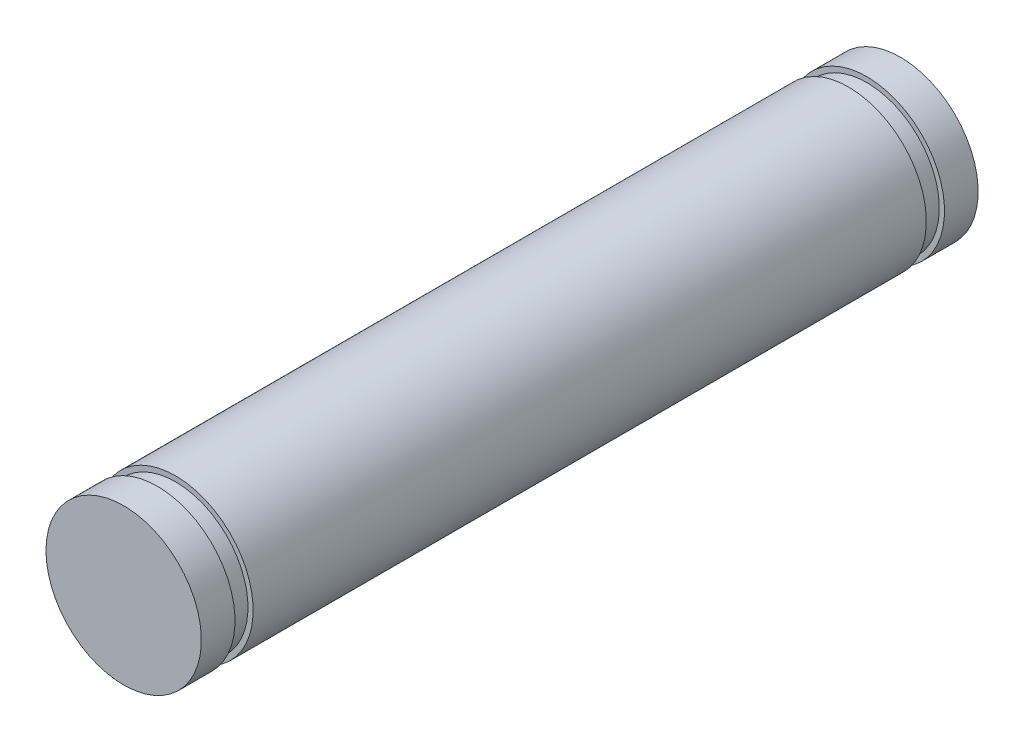
ISO-10303-21;
HEADER;
FILE_DESCRIPTION(('STEP AP214'),'2;1');
FILE_NAME('part.step','',(''),(''),'','','');
FILE_SCHEMA(('AUTOMOTIVE_DESIGN { 1 0 10303 214 1 1 1 1 }'));
ENDSEC;
DATA;
#1=APPLICATION_CONTEXT('core data for automotive mechanical design processes');
#2=APPLICATION_PROTOCOL_DEFINITION('international standard','automotive_design',2000,#1);
#3=PRODUCT_CONTEXT('',#1,'mechanical');
#4=PRODUCT('Part','Part','',(#3));
#5=PRODUCT_RELATED_PRODUCT_CATEGORY('part','',(#4));
#6=PRODUCT_DEFINITION_FORMATION('','',#4);
#7=PRODUCT_DEFINITION_CONTEXT('part definition',#1,'design');
#8=PRODUCT_DEFINITION('design','',#6,#7);
#9=PRODUCT_DEFINITION_SHAPE('','',#8);
#10=(LENGTH_UNIT() NAMED_UNIT(*) SI_UNIT(.MILLI.,.METRE.));
#11=(NAMED_UNIT(*) PLANE_ANGLE_UNIT() SI_UNIT($,.RADIAN.));
#12=(NAMED_UNIT(*) SI_UNIT($,.STERADIAN.) SOLID_ANGLE_UNIT());
#13=UNCERTAINTY_MEASURE_WITH_UNIT(LENGTH_MEASURE(1.E-05),#10,'distance_accuracy_value','');
#14=(GEOMETRIC_REPRESENTATION_CONTEXT(3) GLOBAL_UNCERTAINTY_ASSIGNED_CONTEXT((#13)) GLOBAL_UNIT_ASSIGNED_CONTEXT((#10,
#11,#12)) REPRESENTATION_CONTEXT('',''));
#15=CARTESIAN_POINT('',(0.,0.,0.));
#16=DIRECTION('',(0.,0.,1.));
#17=DIRECTION('',(1.,0.,0.));
#18=AXIS2_PLACEMENT_3D('',#15,#16,#17);
#19=CARTESIAN_POINT('',(0.,0.,30.));
#20=DIRECTION('',(0.,0.,1.));
#21=DIRECTION('',(1.,0.,0.));
#22=AXIS2_PLACEMENT_3D('',#19,#20,#21);
#23=PLANE('',#22);
#24=CARTESIAN_POINT('',(0.,0.,30.));
#25=DIRECTION('',(0.,0.,-1.));
#26=DIRECTION('',(-1.,0.,0.));
#27=AXIS2_PLACEMENT_3D('',#24,#25,#26);
#28=CIRCLE('',#27,3.);
#29=CARTESIAN_POINT('',(-3.,0.,30.));
#30=VERTEX_POINT('',#29);
#31=EDGE_CURVE('E18',#30,#30,#28,.T.);
#32=ORIENTED_EDGE('',*,*,#31,.F.);
#33=EDGE_LOOP('',(#32));
#34=FACE_BOUND('',#33,.T.);
#35=ADVANCED_FACE('F15',(#34),#23,.T.);
#36=CARTESIAN_POINT('',(0.,0.,0.));
#37=DIRECTION('',(0.,0.,1.));
#38=DIRECTION('',(1.,0.,0.));
#39=AXIS2_PLACEMENT_3D('',#36,#37,#38);
#40=PLANE('',#39);
#41=CARTESIAN_POINT('',(0.,0.,0.));
#42=DIRECTION('',(0.,0.,-1.));
#43=DIRECTION('',(-1.,0.,0.));
#44=AXIS2_PLACEMENT_3D('',#41,#42,#43);
#45=CIRCLE('',#44,3.);
#46=CARTESIAN_POINT('',(-3.,0.,0.));
#47=VERTEX_POINT('',#46);
#48=EDGE_CURVE('E46',#47,#47,#45,.F.);
#49=ORIENTED_EDGE('',*,*,#48,.F.);
#50=EDGE_LOOP('',(#49));
#51=FACE_BOUND('',#50,.T.);
#52=ADVANCED_FACE('F57',(#51),#40,.F.);
#53=CARTESIAN_POINT('',(0.,0.,30.));
#54=DIRECTION('',(0.,0.,-1.));
#55=DIRECTION('',(-1.,0.,0.));
#56=AXIS2_PLACEMENT_3D('',#53,#54,#55);
#57=CYLINDRICAL_SURFACE('',#56,3.);
#58=ORIENTED_EDGE('',*,*,#31,.T.);
#59=EDGE_LOOP('',(#58));
#60=FACE_BOUND('',#59,.T.);
#61=CARTESIAN_POINT('',(0.,0.,28.7));
#62=DIRECTION('',(0.,0.,-1.));
#63=DIRECTION('',(-1.,0.,0.));
#64=AXIS2_PLACEMENT_3D('',#61,#62,#63);
#65=CIRCLE('',#64,3.);
#66=CARTESIAN_POINT('',(-3.,0.,28.7));
#67=VERTEX_POINT('',#66);
#68=EDGE_CURVE('E44',#67,#67,#65,.T.);
#69=ORIENTED_EDGE('',*,*,#68,.F.);
#70=EDGE_LOOP('',(#69));
#71=FACE_BOUND('',#70,.T.);
#72=ADVANCED_FACE('F53',(#60,#71),#57,.T.);
#73=CARTESIAN_POINT('',(0.,0.,30.));
#74=DIRECTION('',(0.,0.,-1.));
#75=DIRECTION('',(-1.,0.,0.));
#76=AXIS2_PLACEMENT_3D('',#73,#74,#75);
#77=CYLINDRICAL_SURFACE('',#76,3.);
#78=CARTESIAN_POINT('',(0.,0.,1.3));
#79=DIRECTION('',(0.,0.,-1.));
#80=DIRECTION('',(-1.,0.,0.));
#81=AXIS2_PLACEMENT_3D('',#78,#79,#80);
#82=CIRCLE('',#81,3.);
#83=CARTESIAN_POINT('',(-3.,0.,1.3));
#84=VERTEX_POINT('',#83);
#85=EDGE_CURVE('E41',#84,#84,#82,.F.);
#86=ORIENTED_EDGE('',*,*,#85,.F.);
#87=EDGE_LOOP('',(#86));
#88=FACE_BOUND('',#87,.T.);
#89=ORIENTED_EDGE('',*,*,#48,.T.);
#90=EDGE_LOOP('',(#89));
#91=FACE_BOUND('',#90,.T.);
#92=ADVANCED_FACE('F93',(#88,#91),#77,.T.);
#93=CARTESIAN_POINT('',(3.,0.,28.7));
#94=DIRECTION('',(0.,0.,-1.));
#95=DIRECTION('',(-1.,0.,0.));
#96=AXIS2_PLACEMENT_3D('',#93,#94,#95);
#97=PLANE('',#96);
#98=CARTESIAN_POINT('',(0.,0.,28.7));
#99=DIRECTION('',(0.,0.,-1.));
#100=DIRECTION('',(-1.,0.,0.));
#101=AXIS2_PLACEMENT_3D('',#98,#99,#100);
#102=CIRCLE('',#101,2.8);
#103=CARTESIAN_POINT('',(-2.8,0.,28.7));
#104=VERTEX_POINT('',#103);
#105=EDGE_CURVE('E38',#104,#104,#102,.T.);
#106=ORIENTED_EDGE('',*,*,#105,.F.);
#107=EDGE_LOOP('',(#106));
#108=FACE_BOUND('',#107,.T.);
#109=ORIENTED_EDGE('',*,*,#68,.T.);
#110=EDGE_LOOP('',(#109));
#111=FACE_BOUND('',#110,.T.);
#112=ADVANCED_FACE('F89',(#108,#111),#97,.T.);
#113=CARTESIAN_POINT('',(3.,0.,1.3));
#114=DIRECTION('',(0.,0.,1.));
#115=DIRECTION('',(1.,0.,0.));
#116=AXIS2_PLACEMENT_3D('',#113,#114,#115);
#117=PLANE('',#116);
#118=ORIENTED_EDGE('',*,*,#85,.T.);
#119=EDGE_LOOP('',(#118));
#120=FACE_BOUND('',#119,.T.);
#121=CARTESIAN_POINT('',(0.,0.,1.3));
#122=DIRECTION('',(0.,0.,-1.));
#123=DIRECTION('',(-1.,0.,0.));
#124=AXIS2_PLACEMENT_3D('',#121,#122,#123);
#125=CIRCLE('',#124,2.8);
#126=CARTESIAN_POINT('',(-2.8,0.,1.3));
#127=VERTEX_POINT('',#126);
#128=EDGE_CURVE('E35',#127,#127,#125,.F.);
#129=ORIENTED_EDGE('',*,*,#128,.F.);
#130=EDGE_LOOP('',(#129));
#131=FACE_BOUND('',#130,.T.);
#132=ADVANCED_FACE('F85',(#120,#131),#117,.T.);
#133=CARTESIAN_POINT('',(0.,0.,0.));
#134=DIRECTION('',(0.,0.,-1.));
#135=DIRECTION('',(-1.,0.,0.));
#136=AXIS2_PLACEMENT_3D('',#133,#134,#135);
#137=CYLINDRICAL_SURFACE('',#136,2.8);
#138=ORIENTED_EDGE('',*,*,#105,.T.);
#139=EDGE_LOOP('',(#138));
#140=FACE_BOUND('',#139,.T.);
#141=CARTESIAN_POINT('',(0.,0.,28.));
#142=DIRECTION('',(0.,0.,-1.));
#143=DIRECTION('',(-1.,0.,0.));
#144=AXIS2_PLACEMENT_3D('',#141,#142,#143);
#145=CIRCLE('',#144,2.8);
#146=CARTESIAN_POINT('',(-2.8,0.,28.));
#147=VERTEX_POINT('',#146);
#148=EDGE_CURVE('E32',#147,#147,#145,.T.);
#149=ORIENTED_EDGE('',*,*,#148,.F.);
#150=EDGE_LOOP('',(#149));
#151=FACE_BOUND('',#150,.T.);
#152=ADVANCED_FACE('F81',(#140,#151),#137,.T.);
#153=CARTESIAN_POINT('',(0.,0.,0.));
#154=DIRECTION('',(0.,0.,-1.));
#155=DIRECTION('',(-1.,0.,0.));
#156=AXIS2_PLACEMENT_3D('',#153,#154,#155);
#157=CYLINDRICAL_SURFACE('',#156,2.8);
#158=CARTESIAN_POINT('',(0.,0.,2.));
#159=DIRECTION('',(0.,0.,-1.));
#160=DIRECTION('',(-1.,0.,0.));
#161=AXIS2_PLACEMENT_3D('',#158,#159,#160);
#162=CIRCLE('',#161,2.8);
#163=CARTESIAN_POINT('',(-2.8,0.,2.));
#164=VERTEX_POINT('',#163);
#165=EDGE_CURVE('E27',#164,#164,#162,.F.);
#166=ORIENTED_EDGE('',*,*,#165,.F.);
#167=EDGE_LOOP('',(#166));
#168=FACE_BOUND('',#167,.T.);
#169=ORIENTED_EDGE('',*,*,#128,.T.);
#170=EDGE_LOOP('',(#169));
#171=FACE_BOUND('',#170,.T.);
#172=ADVANCED_FACE('F77',(#168,#171),#157,.T.);
#173=CARTESIAN_POINT('',(3.,0.,28.));
#174=DIRECTION('',(0.,0.,1.));
#175=DIRECTION('',(1.,0.,0.));
#176=AXIS2_PLACEMENT_3D('',#173,#174,#175);
#177=PLANE('',#176);
#178=CARTESIAN_POINT('',(0.,0.,28.));
#179=DIRECTION('',(0.,0.,-1.));
#180=DIRECTION('',(-1.,0.,0.));
#181=AXIS2_PLACEMENT_3D('',#178,#179,#180);
#182=CIRCLE('',#181,3.);
#183=CARTESIAN_POINT('',(-3.,0.,28.));
#184=VERTEX_POINT('',#183);
#185=EDGE_CURVE('E22',#184,#184,#182,.T.);
#186=ORIENTED_EDGE('',*,*,#185,.F.);
#187=EDGE_LOOP('',(#186));
#188=FACE_BOUND('',#187,.T.);
#189=ORIENTED_EDGE('',*,*,#148,.T.);
#190=EDGE_LOOP('',(#189));
#191=FACE_BOUND('',#190,.T.);
#192=ADVANCED_FACE('F70',(#188,#191),#177,.T.);
#193=CARTESIAN_POINT('',(3.,0.,2.));
#194=DIRECTION('',(0.,0.,-1.));
#195=DIRECTION('',(-1.,0.,0.));
#196=AXIS2_PLACEMENT_3D('',#193,#194,#195);
#197=PLANE('',#196);
#198=ORIENTED_EDGE('',*,*,#165,.T.);
#199=EDGE_LOOP('',(#198));
#200=FACE_BOUND('',#199,.T.);
#201=CARTESIAN_POINT('',(0.,0.,2.));
#202=DIRECTION('',(0.,0.,-1.));
#203=DIRECTION('',(-1.,0.,0.));
#204=AXIS2_PLACEMENT_3D('',#201,#202,#203);
#205=CIRCLE('',#204,3.);
#206=CARTESIAN_POINT('',(-3.,0.,2.));
#207=VERTEX_POINT('',#206);
#208=EDGE_CURVE('E10',#207,#207,#205,.F.);
#209=ORIENTED_EDGE('',*,*,#208,.F.);
#210=EDGE_LOOP('',(#209));
#211=FACE_BOUND('',#210,.T.);
#212=ADVANCED_FACE('F65',(#200,#211),#197,.T.);
#213=CARTESIAN_POINT('',(0.,0.,30.));
#214=DIRECTION('',(0.,0.,-1.));
#215=DIRECTION('',(-1.,0.,0.));
#216=AXIS2_PLACEMENT_3D('',#213,#214,#215);
#217=CYLINDRICAL_SURFACE('',#216,3.);
#218=ORIENTED_EDGE('',*,*,#208,.T.);
#219=EDGE_LOOP('',(#218));
#220=FACE_BOUND('',#219,.T.);
#221=ORIENTED_EDGE('',*,*,#185,.T.);
#222=EDGE_LOOP('',(#221));
#223=FACE_BOUND('',#222,.T.);
#224=ADVANCED_FACE('F63',(#220,#223),#217,.T.);
#225=CLOSED_SHELL('',(#35,#52,#72,#92,#112,#132,#152,#172,#192,#212,#224));
#226=MANIFOLD_SOLID_BREP('B1',#225);
#227=ADVANCED_BREP_SHAPE_REPRESENTATION('',(#18,#226),#14);
#228=SHAPE_DEFINITION_REPRESENTATION(#9,#227);
ENDSEC;
END-ISO-10303-21;
